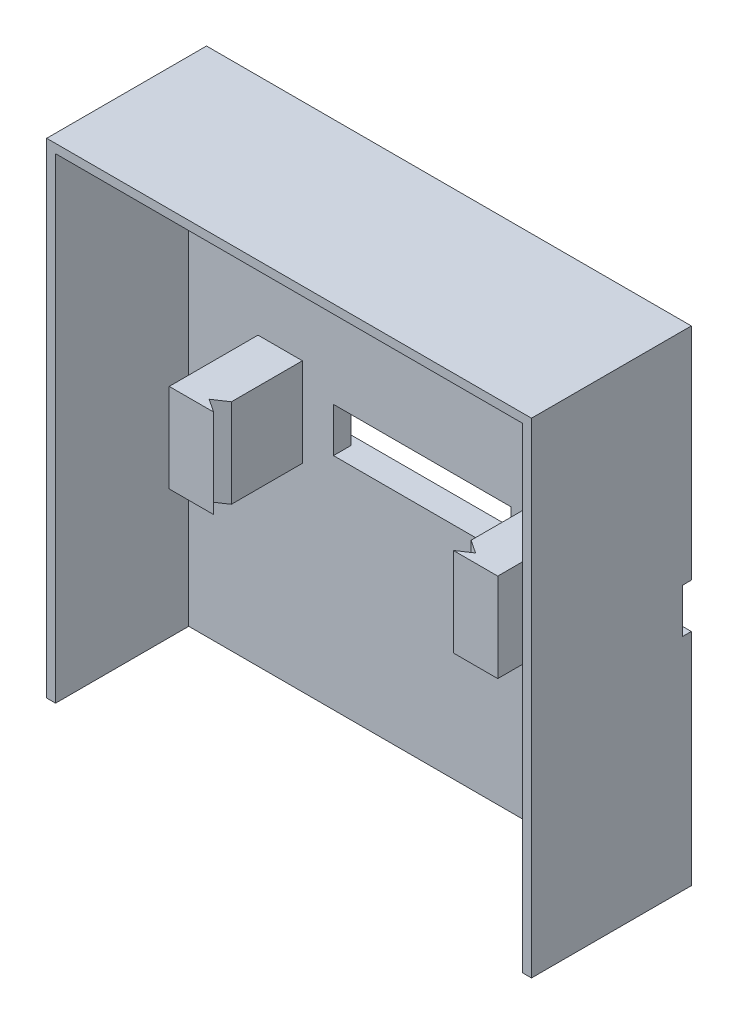
ISO-10303-21;
HEADER;
FILE_DESCRIPTION(('STEP AP214'),'2;1');
FILE_NAME('part.step','',(''),(''),'','','');
FILE_SCHEMA(('AUTOMOTIVE_DESIGN { 1 0 10303 214 1 1 1 1 }'));
ENDSEC;
DATA;
#1=APPLICATION_CONTEXT('core data for automotive mechanical design processes');
#2=APPLICATION_PROTOCOL_DEFINITION('international standard','automotive_design',2000,#1);
#3=PRODUCT_CONTEXT('',#1,'mechanical');
#4=PRODUCT('Part','Part','',(#3));
#5=PRODUCT_RELATED_PRODUCT_CATEGORY('part','',(#4));
#6=PRODUCT_DEFINITION_FORMATION('','',#4);
#7=PRODUCT_DEFINITION_CONTEXT('part definition',#1,'design');
#8=PRODUCT_DEFINITION('design','',#6,#7);
#9=PRODUCT_DEFINITION_SHAPE('','',#8);
#10=(LENGTH_UNIT() NAMED_UNIT(*) SI_UNIT(.MILLI.,.METRE.));
#11=(NAMED_UNIT(*) PLANE_ANGLE_UNIT() SI_UNIT($,.RADIAN.));
#12=(NAMED_UNIT(*) SI_UNIT($,.STERADIAN.) SOLID_ANGLE_UNIT());
#13=UNCERTAINTY_MEASURE_WITH_UNIT(LENGTH_MEASURE(1.E-05),#10,'distance_accuracy_value','');
#14=(GEOMETRIC_REPRESENTATION_CONTEXT(3) GLOBAL_UNCERTAINTY_ASSIGNED_CONTEXT((#13)) GLOBAL_UNIT_ASSIGNED_CONTEXT((#10,
#11,#12)) REPRESENTATION_CONTEXT('',''));
#15=CARTESIAN_POINT('',(0.,0.,0.));
#16=DIRECTION('',(0.,0.,1.));
#17=DIRECTION('',(1.,0.,0.));
#18=AXIS2_PLACEMENT_3D('',#15,#16,#17);
#19=CARTESIAN_POINT('',(0.,0.,3.));
#20=DIRECTION('',(0.,0.,1.));
#21=DIRECTION('',(1.,0.,0.));
#22=AXIS2_PLACEMENT_3D('',#19,#20,#21);
#23=PLANE('',#22);
#24=CARTESIAN_POINT('',(18.3,0.,3.));
#25=DIRECTION('',(0.,0.,1.));
#26=DIRECTION('',(1.,0.,0.));
#27=AXIS2_PLACEMENT_3D('',#24,#25,#26);
#28=CIRCLE('',#27,2.);
#29=CARTESIAN_POINT('',(18.5,-1.98997487421324,3.));
#30=VERTEX_POINT('',#29);
#31=CARTESIAN_POINT('',(18.5,1.98997487421324,3.));
#32=VERTEX_POINT('',#31);
#33=EDGE_CURVE('E254',#30,#32,#28,.T.);
#34=ORIENTED_EDGE('',*,*,#33,.F.);
#35=DIRECTION('',(0.,1.,0.));
#36=VECTOR('',#35,1.);
#37=CARTESIAN_POINT('',(18.5,5.,3.));
#38=LINE('',#37,#36);
#39=CARTESIAN_POINT('',(18.5,-5.,3.));
#40=VERTEX_POINT('',#39);
#41=EDGE_CURVE('E261',#40,#30,#38,.T.);
#42=ORIENTED_EDGE('',*,*,#41,.F.);
#43=DIRECTION('',(1.,0.,0.));
#44=VECTOR('',#43,1.);
#45=CARTESIAN_POINT('',(13.5,-5.,3.));
#46=LINE('',#45,#44);
#47=CARTESIAN_POINT('',(13.5,-5.,3.));
#48=VERTEX_POINT('',#47);
#49=EDGE_CURVE('E366',#48,#40,#46,.T.);
#50=ORIENTED_EDGE('',*,*,#49,.F.);
#51=DIRECTION('',(0.,-1.,0.));
#52=VECTOR('',#51,1.);
#53=CARTESIAN_POINT('',(13.5,5.,3.));
#54=LINE('',#53,#52);
#55=CARTESIAN_POINT('',(13.5,5.,3.));
#56=VERTEX_POINT('',#55);
#57=EDGE_CURVE('E379',#56,#48,#54,.T.);
#58=ORIENTED_EDGE('',*,*,#57,.F.);
#59=DIRECTION('',(-1.,0.,0.));
#60=VECTOR('',#59,1.);
#61=CARTESIAN_POINT('',(13.5,5.,3.));
#62=LINE('',#61,#60);
#63=CARTESIAN_POINT('',(18.5,5.,3.));
#64=VERTEX_POINT('',#63);
#65=EDGE_CURVE('E376',#64,#56,#62,.T.);
#66=ORIENTED_EDGE('',*,*,#65,.F.);
#67=EDGE_CURVE('E346',#32,#64,#38,.T.);
#68=ORIENTED_EDGE('',*,*,#67,.F.);
#69=EDGE_LOOP('',(#34,#42,#50,#58,#66,#68));
#70=FACE_BOUND('',#69,.T.);
#71=CARTESIAN_POINT('',(-18.3,0.,3.));
#72=DIRECTION('',(0.,0.,1.));
#73=DIRECTION('',(1.,0.,0.));
#74=AXIS2_PLACEMENT_3D('',#71,#72,#73);
#75=CIRCLE('',#74,2.);
#76=CARTESIAN_POINT('',(-18.5,1.98997487421324,3.));
#77=VERTEX_POINT('',#76);
#78=CARTESIAN_POINT('',(-18.5,-1.98997487421324,3.));
#79=VERTEX_POINT('',#78);
#80=EDGE_CURVE('E278',#77,#79,#75,.T.);
#81=ORIENTED_EDGE('',*,*,#80,.F.);
#82=DIRECTION('',(0.,-1.,0.));
#83=VECTOR('',#82,1.);
#84=CARTESIAN_POINT('',(-18.5,5.,3.));
#85=LINE('',#84,#83);
#86=CARTESIAN_POINT('',(-18.5,5.,3.));
#87=VERTEX_POINT('',#86);
#88=EDGE_CURVE('E274',#87,#77,#85,.T.);
#89=ORIENTED_EDGE('',*,*,#88,.F.);
#90=DIRECTION('',(-1.,0.,0.));
#91=VECTOR('',#90,1.);
#92=CARTESIAN_POINT('',(-13.5,5.,3.));
#93=LINE('',#92,#91);
#94=CARTESIAN_POINT('',(-13.5,5.,3.));
#95=VERTEX_POINT('',#94);
#96=EDGE_CURVE('E395',#95,#87,#93,.T.);
#97=ORIENTED_EDGE('',*,*,#96,.F.);
#98=DIRECTION('',(0.,1.,0.));
#99=VECTOR('',#98,1.);
#100=CARTESIAN_POINT('',(-13.5,5.,3.));
#101=LINE('',#100,#99);
#102=CARTESIAN_POINT('',(-13.5,-5.,3.));
#103=VERTEX_POINT('',#102);
#104=EDGE_CURVE('E408',#103,#95,#101,.T.);
#105=ORIENTED_EDGE('',*,*,#104,.F.);
#106=DIRECTION('',(1.,0.,0.));
#107=VECTOR('',#106,1.);
#108=CARTESIAN_POINT('',(-13.5,-5.,3.));
#109=LINE('',#108,#107);
#110=CARTESIAN_POINT('',(-18.5,-5.,3.));
#111=VERTEX_POINT('',#110);
#112=EDGE_CURVE('E405',#111,#103,#109,.T.);
#113=ORIENTED_EDGE('',*,*,#112,.F.);
#114=EDGE_CURVE('E284',#79,#111,#85,.T.);
#115=ORIENTED_EDGE('',*,*,#114,.F.);
#116=EDGE_LOOP('',(#81,#89,#97,#105,#113,#115));
#117=FACE_BOUND('',#116,.T.);
#118=DIRECTION('',(0.,1.,0.));
#119=VECTOR('',#118,1.);
#120=CARTESIAN_POINT('',(9.99999999999999,2.5,3.));
#121=LINE('',#120,#119);
#122=CARTESIAN_POINT('',(9.99999999999999,-2.5,3.));
#123=VERTEX_POINT('',#122);
#124=CARTESIAN_POINT('',(9.99999999999999,2.5,3.));
#125=VERTEX_POINT('',#124);
#126=EDGE_CURVE('E442',#123,#125,#121,.T.);
#127=ORIENTED_EDGE('',*,*,#126,.F.);
#128=DIRECTION('',(1.,0.,0.));
#129=VECTOR('',#128,1.);
#130=CARTESIAN_POINT('',(-10.,-2.5,3.));
#131=LINE('',#130,#129);
#132=CARTESIAN_POINT('',(-10.,-2.5,3.));
#133=VERTEX_POINT('',#132);
#134=EDGE_CURVE('E452',#133,#123,#131,.T.);
#135=ORIENTED_EDGE('',*,*,#134,.F.);
#136=DIRECTION('',(0.,-1.,0.));
#137=VECTOR('',#136,1.);
#138=CARTESIAN_POINT('',(-10.,2.5,3.));
#139=LINE('',#138,#137);
#140=CARTESIAN_POINT('',(-10.,2.5,3.));
#141=VERTEX_POINT('',#140);
#142=EDGE_CURVE('E459',#141,#133,#139,.T.);
#143=ORIENTED_EDGE('',*,*,#142,.F.);
#144=DIRECTION('',(-1.,0.,0.));
#145=VECTOR('',#144,1.);
#146=CARTESIAN_POINT('',(-10.,2.5,3.));
#147=LINE('',#146,#145);
#148=EDGE_CURVE('E456',#125,#141,#147,.T.);
#149=ORIENTED_EDGE('',*,*,#148,.F.);
#150=EDGE_LOOP('',(#127,#135,#143,#149));
#151=FACE_BOUND('',#150,.T.);
#152=DIRECTION('',(-1.,0.,0.));
#153=VECTOR('',#152,1.);
#154=CARTESIAN_POINT('',(27.3,-27.3,3.));
#155=LINE('',#154,#153);
#156=CARTESIAN_POINT('',(26.3,-27.3,3.));
#157=VERTEX_POINT('',#156);
#158=CARTESIAN_POINT('',(-26.3,-27.3,3.));
#159=VERTEX_POINT('',#158);
#160=EDGE_CURVE('E473',#157,#159,#155,.T.);
#161=ORIENTED_EDGE('',*,*,#160,.F.);
#162=DIRECTION('',(0.,-1.,0.));
#163=VECTOR('',#162,1.);
#164=CARTESIAN_POINT('',(26.3,0.,3.));
#165=LINE('',#164,#163);
#166=CARTESIAN_POINT('',(26.3,26.3,3.));
#167=VERTEX_POINT('',#166);
#168=EDGE_CURVE('E288',#167,#157,#165,.T.);
#169=ORIENTED_EDGE('',*,*,#168,.F.);
#170=DIRECTION('',(1.,0.,0.));
#171=VECTOR('',#170,1.);
#172=CARTESIAN_POINT('',(0.,26.3,3.));
#173=LINE('',#172,#171);
#174=CARTESIAN_POINT('',(-26.3,26.3,3.));
#175=VERTEX_POINT('',#174);
#176=EDGE_CURVE('E285',#175,#167,#173,.T.);
#177=ORIENTED_EDGE('',*,*,#176,.F.);
#178=DIRECTION('',(0.,-1.,0.));
#179=VECTOR('',#178,1.);
#180=CARTESIAN_POINT('',(-26.3,0.,3.));
#181=LINE('',#180,#179);
#182=EDGE_CURVE('E297',#175,#159,#181,.T.);
#183=ORIENTED_EDGE('',*,*,#182,.T.);
#184=EDGE_LOOP('',(#161,#169,#177,#183));
#185=FACE_BOUND('',#184,.T.);
#186=ADVANCED_FACE('F35',(#70,#117,#151,#185),#23,.T.);
#187=CARTESIAN_POINT('',(27.3,27.3,3.));
#188=DIRECTION('',(1.,0.,0.));
#189=DIRECTION('',(0.,1.,0.));
#190=AXIS2_PLACEMENT_3D('',#187,#188,#189);
#191=PLANE('',#190);
#192=DIRECTION('',(0.,-1.,0.));
#193=VECTOR('',#192,1.);
#194=CARTESIAN_POINT('',(27.3,2.5,1.));
#195=LINE('',#194,#193);
#196=CARTESIAN_POINT('',(27.3,2.5,1.));
#197=VERTEX_POINT('',#196);
#198=CARTESIAN_POINT('',(27.3,-2.5,1.));
#199=VERTEX_POINT('',#198);
#200=EDGE_CURVE('E421',#197,#199,#195,.T.);
#201=ORIENTED_EDGE('',*,*,#200,.F.);
#202=DIRECTION('',(0.,0.,-1.));
#203=VECTOR('',#202,1.);
#204=CARTESIAN_POINT('',(27.3,2.5,1.));
#205=LINE('',#204,#203);
#206=CARTESIAN_POINT('',(27.3,2.5,0.));
#207=VERTEX_POINT('',#206);
#208=EDGE_CURVE('E439',#197,#207,#205,.T.);
#209=ORIENTED_EDGE('',*,*,#208,.T.);
#210=DIRECTION('',(0.,-1.,0.));
#211=VECTOR('',#210,1.);
#212=CARTESIAN_POINT('',(27.3,27.3,0.));
#213=LINE('',#212,#211);
#214=CARTESIAN_POINT('',(27.3,27.3,0.));
#215=VERTEX_POINT('',#214);
#216=EDGE_CURVE('E477',#215,#207,#213,.T.);
#217=ORIENTED_EDGE('',*,*,#216,.F.);
#218=DIRECTION('',(0.,0.,-1.));
#219=VECTOR('',#218,1.);
#220=CARTESIAN_POINT('',(27.3,27.3,3.));
#221=LINE('',#220,#219);
#222=CARTESIAN_POINT('',(27.3,27.3,18.));
#223=VERTEX_POINT('',#222);
#224=EDGE_CURVE('E491',#223,#215,#221,.T.);
#225=ORIENTED_EDGE('',*,*,#224,.F.);
#226=DIRECTION('',(0.,1.,0.));
#227=VECTOR('',#226,1.);
#228=CARTESIAN_POINT('',(27.3,0.,18.));
#229=LINE('',#228,#227);
#230=CARTESIAN_POINT('',(27.3,-27.3,18.));
#231=VERTEX_POINT('',#230);
#232=EDGE_CURVE('E302',#231,#223,#229,.T.);
#233=ORIENTED_EDGE('',*,*,#232,.F.);
#234=DIRECTION('',(0.,0.,-1.));
#235=VECTOR('',#234,1.);
#236=CARTESIAN_POINT('',(27.3,-27.3,3.));
#237=LINE('',#236,#235);
#238=CARTESIAN_POINT('',(27.3,-27.3,0.));
#239=VERTEX_POINT('',#238);
#240=EDGE_CURVE('E248',#231,#239,#237,.T.);
#241=ORIENTED_EDGE('',*,*,#240,.T.);
#242=CARTESIAN_POINT('',(27.3,-2.5,0.));
#243=VERTEX_POINT('',#242);
#244=EDGE_CURVE('E486',#243,#239,#213,.T.);
#245=ORIENTED_EDGE('',*,*,#244,.F.);
#246=DIRECTION('',(0.,0.,-1.));
#247=VECTOR('',#246,1.);
#248=CARTESIAN_POINT('',(27.3,-2.5,1.));
#249=LINE('',#248,#247);
#250=EDGE_CURVE('E435',#199,#243,#249,.T.);
#251=ORIENTED_EDGE('',*,*,#250,.F.);
#252=EDGE_LOOP('',(#201,#209,#217,#225,#233,#241,#245,#251));
#253=FACE_BOUND('',#252,.T.);
#254=ADVANCED_FACE('F511',(#253),#191,.T.);
#255=CARTESIAN_POINT('',(-27.3,27.3,3.));
#256=DIRECTION('',(1.,0.,0.));
#257=DIRECTION('',(0.,1.,0.));
#258=AXIS2_PLACEMENT_3D('',#255,#256,#257);
#259=PLANE('',#258);
#260=DIRECTION('',(0.,0.,-1.));
#261=VECTOR('',#260,1.);
#262=CARTESIAN_POINT('',(-27.3,2.5,1.));
#263=LINE('',#262,#261);
#264=CARTESIAN_POINT('',(-27.3,2.5,1.));
#265=VERTEX_POINT('',#264);
#266=CARTESIAN_POINT('',(-27.3,2.5,0.));
#267=VERTEX_POINT('',#266);
#268=EDGE_CURVE('E443',#265,#267,#263,.T.);
#269=ORIENTED_EDGE('',*,*,#268,.F.);
#270=DIRECTION('',(0.,-1.,0.));
#271=VECTOR('',#270,1.);
#272=CARTESIAN_POINT('',(-27.3,2.5,1.));
#273=LINE('',#272,#271);
#274=CARTESIAN_POINT('',(-27.3,-2.5,1.));
#275=VERTEX_POINT('',#274);
#276=EDGE_CURVE('E428',#265,#275,#273,.T.);
#277=ORIENTED_EDGE('',*,*,#276,.T.);
#278=DIRECTION('',(0.,0.,-1.));
#279=VECTOR('',#278,1.);
#280=CARTESIAN_POINT('',(-27.3,-2.5,1.));
#281=LINE('',#280,#279);
#282=CARTESIAN_POINT('',(-27.3,-2.5,0.));
#283=VERTEX_POINT('',#282);
#284=EDGE_CURVE('E445',#275,#283,#281,.T.);
#285=ORIENTED_EDGE('',*,*,#284,.T.);
#286=DIRECTION('',(0.,-1.,0.));
#287=VECTOR('',#286,1.);
#288=CARTESIAN_POINT('',(-27.3,27.3,0.));
#289=LINE('',#288,#287);
#290=CARTESIAN_POINT('',(-27.3,-27.3,0.));
#291=VERTEX_POINT('',#290);
#292=EDGE_CURVE('E480',#283,#291,#289,.T.);
#293=ORIENTED_EDGE('',*,*,#292,.T.);
#294=DIRECTION('',(0.,0.,-1.));
#295=VECTOR('',#294,1.);
#296=CARTESIAN_POINT('',(-27.3,-27.3,3.));
#297=LINE('',#296,#295);
#298=CARTESIAN_POINT('',(-27.3,-27.3,18.));
#299=VERTEX_POINT('',#298);
#300=EDGE_CURVE('E476',#299,#291,#297,.T.);
#301=ORIENTED_EDGE('',*,*,#300,.F.);
#302=DIRECTION('',(0.,-1.,0.));
#303=VECTOR('',#302,1.);
#304=CARTESIAN_POINT('',(-27.3,0.,18.));
#305=LINE('',#304,#303);
#306=CARTESIAN_POINT('',(-27.3,27.3,18.));
#307=VERTEX_POINT('',#306);
#308=EDGE_CURVE('E309',#307,#299,#305,.T.);
#309=ORIENTED_EDGE('',*,*,#308,.F.);
#310=DIRECTION('',(0.,0.,-1.));
#311=VECTOR('',#310,1.);
#312=CARTESIAN_POINT('',(-27.3,27.3,3.));
#313=LINE('',#312,#311);
#314=CARTESIAN_POINT('',(-27.3,27.3,0.));
#315=VERTEX_POINT('',#314);
#316=EDGE_CURVE('E493',#307,#315,#313,.T.);
#317=ORIENTED_EDGE('',*,*,#316,.T.);
#318=EDGE_CURVE('E481',#315,#267,#289,.T.);
#319=ORIENTED_EDGE('',*,*,#318,.T.);
#320=EDGE_LOOP('',(#269,#277,#285,#293,#301,#309,#317,#319));
#321=FACE_BOUND('',#320,.T.);
#322=ADVANCED_FACE('F527',(#321),#259,.F.);
#323=CARTESIAN_POINT('',(0.,0.,0.));
#324=DIRECTION('',(0.,0.,1.));
#325=DIRECTION('',(1.,0.,0.));
#326=AXIS2_PLACEMENT_3D('',#323,#324,#325);
#327=PLANE('',#326);
#328=DIRECTION('',(-1.,0.,0.));
#329=VECTOR('',#328,1.);
#330=CARTESIAN_POINT('',(27.3,2.5,0.));
#331=LINE('',#330,#329);
#332=EDGE_CURVE('E425',#207,#267,#331,.T.);
#333=ORIENTED_EDGE('',*,*,#332,.T.);
#334=ORIENTED_EDGE('',*,*,#318,.F.);
#335=DIRECTION('',(-1.,0.,0.));
#336=VECTOR('',#335,1.);
#337=CARTESIAN_POINT('',(27.3,27.3,0.));
#338=LINE('',#337,#336);
#339=EDGE_CURVE('E484',#215,#315,#338,.T.);
#340=ORIENTED_EDGE('',*,*,#339,.F.);
#341=ORIENTED_EDGE('',*,*,#216,.T.);
#342=EDGE_LOOP('',(#333,#334,#340,#341));
#343=FACE_BOUND('',#342,.T.);
#344=ADVANCED_FACE('F532',(#343),#327,.F.);
#345=CARTESIAN_POINT('',(27.3,-27.3,3.));
#346=DIRECTION('',(0.,-1.,0.));
#347=DIRECTION('',(1.,0.,0.));
#348=AXIS2_PLACEMENT_3D('',#345,#346,#347);
#349=PLANE('',#348);
#350=DIRECTION('',(-1.,0.,0.));
#351=VECTOR('',#350,1.);
#352=CARTESIAN_POINT('',(27.3,-27.3,0.));
#353=LINE('',#352,#351);
#354=EDGE_CURVE('E466',#239,#291,#353,.T.);
#355=ORIENTED_EDGE('',*,*,#354,.F.);
#356=ORIENTED_EDGE('',*,*,#240,.F.);
#357=DIRECTION('',(1.,0.,0.));
#358=VECTOR('',#357,1.);
#359=CARTESIAN_POINT('',(0.,-27.3,18.));
#360=LINE('',#359,#358);
#361=CARTESIAN_POINT('',(26.3,-27.3,18.));
#362=VERTEX_POINT('',#361);
#363=EDGE_CURVE('E299',#362,#231,#360,.T.);
#364=ORIENTED_EDGE('',*,*,#363,.F.);
#365=DIRECTION('',(0.,0.,-1.));
#366=VECTOR('',#365,1.);
#367=CARTESIAN_POINT('',(26.3,-27.3,18.));
#368=LINE('',#367,#366);
#369=EDGE_CURVE('E324',#362,#157,#368,.T.);
#370=ORIENTED_EDGE('',*,*,#369,.T.);
#371=ORIENTED_EDGE('',*,*,#160,.T.);
#372=DIRECTION('',(0.,0.,-1.));
#373=VECTOR('',#372,1.);
#374=CARTESIAN_POINT('',(-26.3,-27.3,18.));
#375=LINE('',#374,#373);
#376=CARTESIAN_POINT('',(-26.3,-27.3,18.));
#377=VERTEX_POINT('',#376);
#378=EDGE_CURVE('E321',#377,#159,#375,.T.);
#379=ORIENTED_EDGE('',*,*,#378,.F.);
#380=EDGE_CURVE('E303',#299,#377,#360,.T.);
#381=ORIENTED_EDGE('',*,*,#380,.F.);
#382=ORIENTED_EDGE('',*,*,#300,.T.);
#383=EDGE_LOOP('',(#355,#356,#364,#370,#371,#379,#381,#382));
#384=FACE_BOUND('',#383,.T.);
#385=ADVANCED_FACE('F37',(#384),#349,.T.);
#386=CARTESIAN_POINT('',(27.3,27.3,3.));
#387=DIRECTION('',(0.,-1.,0.));
#388=DIRECTION('',(1.,0.,0.));
#389=AXIS2_PLACEMENT_3D('',#386,#387,#388);
#390=PLANE('',#389);
#391=ORIENTED_EDGE('',*,*,#339,.T.);
#392=ORIENTED_EDGE('',*,*,#316,.F.);
#393=DIRECTION('',(-1.,0.,0.));
#394=VECTOR('',#393,1.);
#395=CARTESIAN_POINT('',(0.,27.3,18.));
#396=LINE('',#395,#394);
#397=EDGE_CURVE('E306',#223,#307,#396,.T.);
#398=ORIENTED_EDGE('',*,*,#397,.F.);
#399=ORIENTED_EDGE('',*,*,#224,.T.);
#400=EDGE_LOOP('',(#391,#392,#398,#399));
#401=FACE_BOUND('',#400,.T.);
#402=ADVANCED_FACE('F579',(#401),#390,.F.);
#403=ORIENTED_EDGE('',*,*,#292,.F.);
#404=DIRECTION('',(-1.,0.,0.));
#405=VECTOR('',#404,1.);
#406=CARTESIAN_POINT('',(27.3,-2.5,0.));
#407=LINE('',#406,#405);
#408=EDGE_CURVE('E420',#243,#283,#407,.T.);
#409=ORIENTED_EDGE('',*,*,#408,.F.);
#410=ORIENTED_EDGE('',*,*,#244,.T.);
#411=ORIENTED_EDGE('',*,*,#354,.T.);
#412=EDGE_LOOP('',(#403,#409,#410,#411));
#413=FACE_BOUND('',#412,.T.);
#414=ADVANCED_FACE('F504',(#413),#327,.F.);
#415=CARTESIAN_POINT('',(9.99999999999999,2.5,1.));
#416=DIRECTION('',(1.,0.,0.));
#417=DIRECTION('',(0.,0.,-1.));
#418=AXIS2_PLACEMENT_3D('',#415,#416,#417);
#419=PLANE('',#418);
#420=ORIENTED_EDGE('',*,*,#126,.T.);
#421=DIRECTION('',(0.,0.,1.));
#422=VECTOR('',#421,1.);
#423=CARTESIAN_POINT('',(9.99999999999999,2.5,1.));
#424=LINE('',#423,#422);
#425=CARTESIAN_POINT('',(10.,2.5,1.));
#426=VERTEX_POINT('',#425);
#427=EDGE_CURVE('E454',#426,#125,#424,.T.);
#428=ORIENTED_EDGE('',*,*,#427,.F.);
#429=DIRECTION('',(0.,1.,0.));
#430=VECTOR('',#429,1.);
#431=CARTESIAN_POINT('',(9.99999999999999,2.5,1.));
#432=LINE('',#431,#430);
#433=CARTESIAN_POINT('',(10.,-2.5,1.));
#434=VERTEX_POINT('',#433);
#435=EDGE_CURVE('E449',#434,#426,#432,.T.);
#436=ORIENTED_EDGE('',*,*,#435,.F.);
#437=DIRECTION('',(0.,0.,1.));
#438=VECTOR('',#437,1.);
#439=CARTESIAN_POINT('',(9.99999999999999,-2.5,1.));
#440=LINE('',#439,#438);
#441=EDGE_CURVE('E464',#434,#123,#440,.T.);
#442=ORIENTED_EDGE('',*,*,#441,.T.);
#443=EDGE_LOOP('',(#420,#428,#436,#442));
#444=FACE_BOUND('',#443,.T.);
#445=ADVANCED_FACE('F544',(#444),#419,.F.);
#446=CARTESIAN_POINT('',(-10.,-2.5,1.));
#447=DIRECTION('',(0.,-1.,0.));
#448=DIRECTION('',(0.,0.,-1.));
#449=AXIS2_PLACEMENT_3D('',#446,#447,#448);
#450=PLANE('',#449);
#451=ORIENTED_EDGE('',*,*,#134,.T.);
#452=ORIENTED_EDGE('',*,*,#441,.F.);
#453=DIRECTION('',(-1.,0.,0.));
#454=VECTOR('',#453,1.);
#455=CARTESIAN_POINT('',(27.3,-2.5,1.));
#456=LINE('',#455,#454);
#457=EDGE_CURVE('E426',#199,#434,#456,.T.);
#458=ORIENTED_EDGE('',*,*,#457,.F.);
#459=ORIENTED_EDGE('',*,*,#250,.T.);
#460=ORIENTED_EDGE('',*,*,#408,.T.);
#461=ORIENTED_EDGE('',*,*,#284,.F.);
#462=CARTESIAN_POINT('',(-9.99999999999999,-2.5,1.));
#463=VERTEX_POINT('',#462);
#464=EDGE_CURVE('E424',#463,#275,#456,.T.);
#465=ORIENTED_EDGE('',*,*,#464,.F.);
#466=DIRECTION('',(0.,0.,1.));
#467=VECTOR('',#466,1.);
#468=CARTESIAN_POINT('',(-10.,-2.5,1.));
#469=LINE('',#468,#467);
#470=EDGE_CURVE('E467',#463,#133,#469,.T.);
#471=ORIENTED_EDGE('',*,*,#470,.T.);
#472=EDGE_LOOP('',(#451,#452,#458,#459,#460,#461,#465,#471));
#473=FACE_BOUND('',#472,.T.);
#474=ADVANCED_FACE('F559',(#473),#450,.F.);
#475=CARTESIAN_POINT('',(-10.,2.5,1.));
#476=DIRECTION('',(-1.,0.,0.));
#477=DIRECTION('',(0.,0.,1.));
#478=AXIS2_PLACEMENT_3D('',#475,#476,#477);
#479=PLANE('',#478);
#480=ORIENTED_EDGE('',*,*,#142,.T.);
#481=ORIENTED_EDGE('',*,*,#470,.F.);
#482=DIRECTION('',(0.,-1.,0.));
#483=VECTOR('',#482,1.);
#484=CARTESIAN_POINT('',(-10.,2.5,1.));
#485=LINE('',#484,#483);
#486=CARTESIAN_POINT('',(-10.,2.5,1.));
#487=VERTEX_POINT('',#486);
#488=EDGE_CURVE('E451',#487,#463,#485,.T.);
#489=ORIENTED_EDGE('',*,*,#488,.F.);
#490=DIRECTION('',(0.,0.,1.));
#491=VECTOR('',#490,1.);
#492=CARTESIAN_POINT('',(-10.,2.5,1.));
#493=LINE('',#492,#491);
#494=EDGE_CURVE('E469',#487,#141,#493,.T.);
#495=ORIENTED_EDGE('',*,*,#494,.T.);
#496=EDGE_LOOP('',(#480,#481,#489,#495));
#497=FACE_BOUND('',#496,.T.);
#498=ADVANCED_FACE('F553',(#497),#479,.F.);
#499=CARTESIAN_POINT('',(-10.,2.5,1.));
#500=DIRECTION('',(0.,1.,0.));
#501=DIRECTION('',(0.,0.,1.));
#502=AXIS2_PLACEMENT_3D('',#499,#500,#501);
#503=PLANE('',#502);
#504=ORIENTED_EDGE('',*,*,#148,.T.);
#505=ORIENTED_EDGE('',*,*,#494,.F.);
#506=DIRECTION('',(-1.,0.,0.));
#507=VECTOR('',#506,1.);
#508=CARTESIAN_POINT('',(27.3,2.5,1.));
#509=LINE('',#508,#507);
#510=EDGE_CURVE('E431',#487,#265,#509,.T.);
#511=ORIENTED_EDGE('',*,*,#510,.T.);
#512=ORIENTED_EDGE('',*,*,#268,.T.);
#513=ORIENTED_EDGE('',*,*,#332,.F.);
#514=ORIENTED_EDGE('',*,*,#208,.F.);
#515=EDGE_CURVE('E432',#197,#426,#509,.T.);
#516=ORIENTED_EDGE('',*,*,#515,.T.);
#517=ORIENTED_EDGE('',*,*,#427,.T.);
#518=EDGE_LOOP('',(#504,#505,#511,#512,#513,#514,#516,#517));
#519=FACE_BOUND('',#518,.T.);
#520=ADVANCED_FACE('F535',(#519),#503,.F.);
#521=CARTESIAN_POINT('',(0.,0.,1.));
#522=DIRECTION('',(0.,0.,-1.));
#523=DIRECTION('',(-1.,0.,0.));
#524=AXIS2_PLACEMENT_3D('',#521,#522,#523);
#525=PLANE('',#524);
#526=CARTESIAN_POINT('',(18.3,0.,1.));
#527=DIRECTION('',(0.,0.,-1.));
#528=DIRECTION('',(-1.,0.,0.));
#529=AXIS2_PLACEMENT_3D('',#526,#527,#528);
#530=CIRCLE('',#529,2.);
#531=CARTESIAN_POINT('',(16.3,0.,1.));
#532=VERTEX_POINT('',#531);
#533=EDGE_CURVE('E255',#532,#532,#530,.T.);
#534=ORIENTED_EDGE('',*,*,#533,.F.);
#535=EDGE_LOOP('',(#534));
#536=FACE_BOUND('',#535,.T.);
#537=ORIENTED_EDGE('',*,*,#435,.T.);
#538=ORIENTED_EDGE('',*,*,#515,.F.);
#539=ORIENTED_EDGE('',*,*,#200,.T.);
#540=ORIENTED_EDGE('',*,*,#457,.T.);
#541=EDGE_LOOP('',(#537,#538,#539,#540));
#542=FACE_BOUND('',#541,.T.);
#543=ADVANCED_FACE('F538',(#536,#542),#525,.T.);
#544=CARTESIAN_POINT('',(-18.3,0.,1.));
#545=DIRECTION('',(0.,0.,-1.));
#546=DIRECTION('',(-1.,0.,0.));
#547=AXIS2_PLACEMENT_3D('',#544,#545,#546);
#548=CIRCLE('',#547,2.);
#549=CARTESIAN_POINT('',(-20.3,0.,1.));
#550=VERTEX_POINT('',#549);
#551=EDGE_CURVE('E871',#550,#550,#548,.T.);
#552=ORIENTED_EDGE('',*,*,#551,.F.);
#553=EDGE_LOOP('',(#552));
#554=FACE_BOUND('',#553,.T.);
#555=ORIENTED_EDGE('',*,*,#488,.T.);
#556=ORIENTED_EDGE('',*,*,#464,.T.);
#557=ORIENTED_EDGE('',*,*,#276,.F.);
#558=ORIENTED_EDGE('',*,*,#510,.F.);
#559=EDGE_LOOP('',(#555,#556,#557,#558));
#560=FACE_BOUND('',#559,.T.);
#561=ADVANCED_FACE('F556',(#554,#560),#525,.T.);
#562=CARTESIAN_POINT('',(-18.5,5.,13.));
#563=DIRECTION('',(1.,0.,0.));
#564=DIRECTION('',(0.,1.,0.));
#565=AXIS2_PLACEMENT_3D('',#562,#563,#564);
#566=PLANE('',#565);
#567=DIRECTION('',(0.,1.,0.));
#568=VECTOR('',#567,1.);
#569=CARTESIAN_POINT('',(-18.5,5.,5.));
#570=LINE('',#569,#568);
#571=CARTESIAN_POINT('',(-18.5,-1.98997487421324,5.));
#572=VERTEX_POINT('',#571);
#573=CARTESIAN_POINT('',(-18.5,1.98997487421324,5.));
#574=VERTEX_POINT('',#573);
#575=EDGE_CURVE('E263',#572,#574,#570,.T.);
#576=ORIENTED_EDGE('',*,*,#575,.F.);
#577=DIRECTION('',(0.,0.,-1.));
#578=VECTOR('',#577,1.);
#579=CARTESIAN_POINT('',(-18.5,-1.98997487421324,5.));
#580=LINE('',#579,#578);
#581=EDGE_CURVE('E11',#572,#79,#580,.T.);
#582=ORIENTED_EDGE('',*,*,#581,.T.);
#583=ORIENTED_EDGE('',*,*,#114,.T.);
#584=DIRECTION('',(0.,0.,-1.));
#585=VECTOR('',#584,1.);
#586=CARTESIAN_POINT('',(-18.5,-5.,13.));
#587=LINE('',#586,#585);
#588=CARTESIAN_POINT('',(-18.5,-5.,13.));
#589=VERTEX_POINT('',#588);
#590=EDGE_CURVE('E417',#589,#111,#587,.T.);
#591=ORIENTED_EDGE('',*,*,#590,.F.);
#592=DIRECTION('',(0.,-1.,0.));
#593=VECTOR('',#592,1.);
#594=CARTESIAN_POINT('',(-18.5,5.,13.));
#595=LINE('',#594,#593);
#596=CARTESIAN_POINT('',(-18.5,5.,13.));
#597=VERTEX_POINT('',#596);
#598=EDGE_CURVE('E391',#597,#589,#595,.T.);
#599=ORIENTED_EDGE('',*,*,#598,.F.);
#600=DIRECTION('',(0.,0.,-1.));
#601=VECTOR('',#600,1.);
#602=CARTESIAN_POINT('',(-18.5,5.,13.));
#603=LINE('',#602,#601);
#604=EDGE_CURVE('E403',#597,#87,#603,.T.);
#605=ORIENTED_EDGE('',*,*,#604,.T.);
#606=ORIENTED_EDGE('',*,*,#88,.T.);
#607=DIRECTION('',(0.,0.,-1.));
#608=VECTOR('',#607,1.);
#609=CARTESIAN_POINT('',(-18.5,1.98997487421324,5.));
#610=LINE('',#609,#608);
#611=EDGE_CURVE('E43',#77,#574,#610,.F.);
#612=ORIENTED_EDGE('',*,*,#611,.T.);
#613=EDGE_LOOP('',(#576,#582,#583,#591,#599,#605,#606,#612));
#614=FACE_BOUND('',#613,.T.);
#615=ADVANCED_FACE('F271',(#614),#566,.F.);
#616=CARTESIAN_POINT('',(-13.5,-5.,13.));
#617=DIRECTION('',(0.,1.,0.));
#618=DIRECTION('',(-1.,0.,0.));
#619=AXIS2_PLACEMENT_3D('',#616,#617,#618);
#620=PLANE('',#619);
#621=DIRECTION('',(-0.832050294337844,0.,0.554700196225229));
#622=VECTOR('',#621,1.);
#623=CARTESIAN_POINT('',(-13.5,-5.,11.));
#624=LINE('',#623,#622);
#625=CARTESIAN_POINT('',(-13.5,-5.,11.));
#626=VERTEX_POINT('',#625);
#627=CARTESIAN_POINT('',(-15.,-5.,12.));
#628=VERTEX_POINT('',#627);
#629=EDGE_CURVE('E334',#626,#628,#624,.T.);
#630=ORIENTED_EDGE('',*,*,#629,.T.);
#631=DIRECTION('',(0.832050294337843,0.,0.55470019622523));
#632=VECTOR('',#631,1.);
#633=CARTESIAN_POINT('',(-15.,-5.,12.));
#634=LINE('',#633,#632);
#635=CARTESIAN_POINT('',(-13.5,-5.,13.));
#636=VERTEX_POINT('',#635);
#637=EDGE_CURVE('E331',#628,#636,#634,.T.);
#638=ORIENTED_EDGE('',*,*,#637,.T.);
#639=DIRECTION('',(1.,0.,0.));
#640=VECTOR('',#639,1.);
#641=CARTESIAN_POINT('',(-13.5,-5.,13.));
#642=LINE('',#641,#640);
#643=EDGE_CURVE('E394',#589,#636,#642,.T.);
#644=ORIENTED_EDGE('',*,*,#643,.F.);
#645=ORIENTED_EDGE('',*,*,#590,.T.);
#646=ORIENTED_EDGE('',*,*,#112,.T.);
#647=DIRECTION('',(0.,0.,-1.));
#648=VECTOR('',#647,1.);
#649=CARTESIAN_POINT('',(-13.5,-5.,13.));
#650=LINE('',#649,#648);
#651=EDGE_CURVE('E415',#626,#103,#650,.T.);
#652=ORIENTED_EDGE('',*,*,#651,.F.);
#653=EDGE_LOOP('',(#630,#638,#644,#645,#646,#652));
#654=FACE_BOUND('',#653,.T.);
#655=ADVANCED_FACE('F631',(#654),#620,.F.);
#656=CARTESIAN_POINT('',(-13.5,5.,13.));
#657=DIRECTION('',(-1.,0.,0.));
#658=DIRECTION('',(0.,-1.,0.));
#659=AXIS2_PLACEMENT_3D('',#656,#657,#658);
#660=PLANE('',#659);
#661=DIRECTION('',(0.,0.,-1.));
#662=VECTOR('',#661,1.);
#663=CARTESIAN_POINT('',(-13.5,5.,13.));
#664=LINE('',#663,#662);
#665=CARTESIAN_POINT('',(-13.5,5.,11.));
#666=VERTEX_POINT('',#665);
#667=EDGE_CURVE('E413',#666,#95,#664,.T.);
#668=ORIENTED_EDGE('',*,*,#667,.F.);
#669=DIRECTION('',(0.,1.,0.));
#670=VECTOR('',#669,1.);
#671=CARTESIAN_POINT('',(-13.5,-5.,11.));
#672=LINE('',#671,#670);
#673=EDGE_CURVE('E338',#626,#666,#672,.T.);
#674=ORIENTED_EDGE('',*,*,#673,.F.);
#675=ORIENTED_EDGE('',*,*,#651,.T.);
#676=ORIENTED_EDGE('',*,*,#104,.T.);
#677=EDGE_LOOP('',(#668,#674,#675,#676));
#678=FACE_BOUND('',#677,.T.);
#679=ADVANCED_FACE('F636',(#678),#660,.F.);
#680=CARTESIAN_POINT('',(-13.5,5.,13.));
#681=DIRECTION('',(0.,-1.,0.));
#682=DIRECTION('',(1.,0.,0.));
#683=AXIS2_PLACEMENT_3D('',#680,#681,#682);
#684=PLANE('',#683);
#685=DIRECTION('',(-1.,0.,0.));
#686=VECTOR('',#685,1.);
#687=CARTESIAN_POINT('',(-13.5,5.,13.));
#688=LINE('',#687,#686);
#689=CARTESIAN_POINT('',(-13.5,5.,13.));
#690=VERTEX_POINT('',#689);
#691=EDGE_CURVE('E401',#690,#597,#688,.T.);
#692=ORIENTED_EDGE('',*,*,#691,.F.);
#693=DIRECTION('',(0.832050294337843,0.,0.55470019622523));
#694=VECTOR('',#693,1.);
#695=CARTESIAN_POINT('',(-15.,5.,12.));
#696=LINE('',#695,#694);
#697=CARTESIAN_POINT('',(-15.,5.,12.));
#698=VERTEX_POINT('',#697);
#699=EDGE_CURVE('E339',#698,#690,#696,.T.);
#700=ORIENTED_EDGE('',*,*,#699,.F.);
#701=DIRECTION('',(-0.832050294337844,0.,0.554700196225229));
#702=VECTOR('',#701,1.);
#703=CARTESIAN_POINT('',(-13.5,5.,11.));
#704=LINE('',#703,#702);
#705=EDGE_CURVE('E335',#666,#698,#704,.T.);
#706=ORIENTED_EDGE('',*,*,#705,.F.);
#707=ORIENTED_EDGE('',*,*,#667,.T.);
#708=ORIENTED_EDGE('',*,*,#96,.T.);
#709=ORIENTED_EDGE('',*,*,#604,.F.);
#710=EDGE_LOOP('',(#692,#700,#706,#707,#708,#709));
#711=FACE_BOUND('',#710,.T.);
#712=ADVANCED_FACE('F648',(#711),#684,.F.);
#713=CARTESIAN_POINT('',(0.,0.,13.));
#714=DIRECTION('',(0.,0.,-1.));
#715=DIRECTION('',(-1.,0.,0.));
#716=AXIS2_PLACEMENT_3D('',#713,#714,#715);
#717=PLANE('',#716);
#718=ORIENTED_EDGE('',*,*,#598,.T.);
#719=ORIENTED_EDGE('',*,*,#643,.T.);
#720=DIRECTION('',(0.,1.,0.));
#721=VECTOR('',#720,1.);
#722=CARTESIAN_POINT('',(-13.5,5.,13.));
#723=LINE('',#722,#721);
#724=EDGE_CURVE('E398',#636,#690,#723,.T.);
#725=ORIENTED_EDGE('',*,*,#724,.T.);
#726=ORIENTED_EDGE('',*,*,#691,.T.);
#727=EDGE_LOOP('',(#718,#719,#725,#726));
#728=FACE_BOUND('',#727,.T.);
#729=ADVANCED_FACE('F658',(#728),#717,.F.);
#730=CARTESIAN_POINT('',(18.5,5.,13.));
#731=DIRECTION('',(-1.,0.,0.));
#732=DIRECTION('',(0.,0.,1.));
#733=AXIS2_PLACEMENT_3D('',#730,#731,#732);
#734=PLANE('',#733);
#735=DIRECTION('',(0.,-1.,0.));
#736=VECTOR('',#735,1.);
#737=CARTESIAN_POINT('',(18.5,5.,5.));
#738=LINE('',#737,#736);
#739=CARTESIAN_POINT('',(18.5,1.98997487421324,5.));
#740=VERTEX_POINT('',#739);
#741=CARTESIAN_POINT('',(18.5,-1.98997487421324,5.));
#742=VERTEX_POINT('',#741);
#743=EDGE_CURVE('E242',#740,#742,#738,.T.);
#744=ORIENTED_EDGE('',*,*,#743,.F.);
#745=DIRECTION('',(0.,0.,-1.));
#746=VECTOR('',#745,1.);
#747=CARTESIAN_POINT('',(18.5,1.98997487421324,5.));
#748=LINE('',#747,#746);
#749=EDGE_CURVE('E253',#740,#32,#748,.T.);
#750=ORIENTED_EDGE('',*,*,#749,.T.);
#751=ORIENTED_EDGE('',*,*,#67,.T.);
#752=DIRECTION('',(0.,0.,-1.));
#753=VECTOR('',#752,1.);
#754=CARTESIAN_POINT('',(18.5,5.,13.));
#755=LINE('',#754,#753);
#756=CARTESIAN_POINT('',(18.5,5.,13.));
#757=VERTEX_POINT('',#756);
#758=EDGE_CURVE('E388',#757,#64,#755,.T.);
#759=ORIENTED_EDGE('',*,*,#758,.F.);
#760=DIRECTION('',(0.,1.,0.));
#761=VECTOR('',#760,1.);
#762=CARTESIAN_POINT('',(18.5,5.,13.));
#763=LINE('',#762,#761);
#764=CARTESIAN_POINT('',(18.5,-5.,13.));
#765=VERTEX_POINT('',#764);
#766=EDGE_CURVE('E362',#765,#757,#763,.T.);
#767=ORIENTED_EDGE('',*,*,#766,.F.);
#768=DIRECTION('',(0.,0.,-1.));
#769=VECTOR('',#768,1.);
#770=CARTESIAN_POINT('',(18.5,-5.,13.));
#771=LINE('',#770,#769);
#772=EDGE_CURVE('E374',#765,#40,#771,.T.);
#773=ORIENTED_EDGE('',*,*,#772,.T.);
#774=ORIENTED_EDGE('',*,*,#41,.T.);
#775=DIRECTION('',(0.,0.,-1.));
#776=VECTOR('',#775,1.);
#777=CARTESIAN_POINT('',(18.5,-1.98997487421324,5.));
#778=LINE('',#777,#776);
#779=EDGE_CURVE('E247',#30,#742,#778,.F.);
#780=ORIENTED_EDGE('',*,*,#779,.T.);
#781=EDGE_LOOP('',(#744,#750,#751,#759,#767,#773,#774,#780));
#782=FACE_BOUND('',#781,.T.);
#783=ADVANCED_FACE('F258',(#782),#734,.F.);
#784=CARTESIAN_POINT('',(13.5,5.,13.));
#785=DIRECTION('',(0.,-1.,0.));
#786=DIRECTION('',(1.,0.,0.));
#787=AXIS2_PLACEMENT_3D('',#784,#785,#786);
#788=PLANE('',#787);
#789=DIRECTION('',(-0.832050294337844,0.,-0.554700196225229));
#790=VECTOR('',#789,1.);
#791=CARTESIAN_POINT('',(13.5,5.00000000000001,11.));
#792=LINE('',#791,#790);
#793=CARTESIAN_POINT('',(15.,5.00000000000001,12.));
#794=VERTEX_POINT('',#793);
#795=CARTESIAN_POINT('',(13.5,5.00000000000001,11.));
#796=VERTEX_POINT('',#795);
#797=EDGE_CURVE('E352',#794,#796,#792,.T.);
#798=ORIENTED_EDGE('',*,*,#797,.F.);
#799=DIRECTION('',(0.832050294337843,0.,-0.55470019622523));
#800=VECTOR('',#799,1.);
#801=CARTESIAN_POINT('',(15.,5.00000000000001,12.));
#802=LINE('',#801,#800);
#803=CARTESIAN_POINT('',(13.5,5.00000000000001,13.));
#804=VERTEX_POINT('',#803);
#805=EDGE_CURVE('E330',#804,#794,#802,.T.);
#806=ORIENTED_EDGE('',*,*,#805,.F.);
#807=DIRECTION('',(-1.,0.,0.));
#808=VECTOR('',#807,1.);
#809=CARTESIAN_POINT('',(13.5,5.,13.));
#810=LINE('',#809,#808);
#811=EDGE_CURVE('E365',#757,#804,#810,.T.);
#812=ORIENTED_EDGE('',*,*,#811,.F.);
#813=ORIENTED_EDGE('',*,*,#758,.T.);
#814=ORIENTED_EDGE('',*,*,#65,.T.);
#815=DIRECTION('',(0.,0.,-1.));
#816=VECTOR('',#815,1.);
#817=CARTESIAN_POINT('',(13.5,5.,13.));
#818=LINE('',#817,#816);
#819=EDGE_CURVE('E386',#796,#56,#818,.T.);
#820=ORIENTED_EDGE('',*,*,#819,.F.);
#821=EDGE_LOOP('',(#798,#806,#812,#813,#814,#820));
#822=FACE_BOUND('',#821,.T.);
#823=ADVANCED_FACE('F675',(#822),#788,.F.);
#824=CARTESIAN_POINT('',(13.5,5.,13.));
#825=DIRECTION('',(1.,0.,0.));
#826=DIRECTION('',(0.,1.,0.));
#827=AXIS2_PLACEMENT_3D('',#824,#825,#826);
#828=PLANE('',#827);
#829=DIRECTION('',(0.,0.,-1.));
#830=VECTOR('',#829,1.);
#831=CARTESIAN_POINT('',(13.5,-5.,13.));
#832=LINE('',#831,#830);
#833=CARTESIAN_POINT('',(13.5,-4.99999999999999,11.));
#834=VERTEX_POINT('',#833);
#835=EDGE_CURVE('E384',#834,#48,#832,.T.);
#836=ORIENTED_EDGE('',*,*,#835,.F.);
#837=DIRECTION('',(0.,1.,0.));
#838=VECTOR('',#837,1.);
#839=CARTESIAN_POINT('',(13.5,-4.99999999999999,11.));
#840=LINE('',#839,#838);
#841=EDGE_CURVE('E341',#834,#796,#840,.T.);
#842=ORIENTED_EDGE('',*,*,#841,.T.);
#843=ORIENTED_EDGE('',*,*,#819,.T.);
#844=ORIENTED_EDGE('',*,*,#57,.T.);
#845=EDGE_LOOP('',(#836,#842,#843,#844));
#846=FACE_BOUND('',#845,.T.);
#847=ADVANCED_FACE('F680',(#846),#828,.F.);
#848=CARTESIAN_POINT('',(13.5,-5.,13.));
#849=DIRECTION('',(0.,1.,0.));
#850=DIRECTION('',(0.,0.,1.));
#851=AXIS2_PLACEMENT_3D('',#848,#849,#850);
#852=PLANE('',#851);
#853=DIRECTION('',(1.,0.,0.));
#854=VECTOR('',#853,1.);
#855=CARTESIAN_POINT('',(13.5,-5.,13.));
#856=LINE('',#855,#854);
#857=CARTESIAN_POINT('',(13.5,-5.,13.));
#858=VERTEX_POINT('',#857);
#859=EDGE_CURVE('E372',#858,#765,#856,.T.);
#860=ORIENTED_EDGE('',*,*,#859,.F.);
#861=DIRECTION('',(0.832050294337843,0.,-0.55470019622523));
#862=VECTOR('',#861,1.);
#863=CARTESIAN_POINT('',(15.,-4.99999999999999,12.));
#864=LINE('',#863,#862);
#865=CARTESIAN_POINT('',(15.,-4.99999999999999,12.));
#866=VERTEX_POINT('',#865);
#867=EDGE_CURVE('E348',#858,#866,#864,.T.);
#868=ORIENTED_EDGE('',*,*,#867,.T.);
#869=DIRECTION('',(-0.832050294337844,0.,-0.554700196225229));
#870=VECTOR('',#869,1.);
#871=CARTESIAN_POINT('',(13.5,-4.99999999999999,11.));
#872=LINE('',#871,#870);
#873=EDGE_CURVE('E351',#866,#834,#872,.T.);
#874=ORIENTED_EDGE('',*,*,#873,.T.);
#875=ORIENTED_EDGE('',*,*,#835,.T.);
#876=ORIENTED_EDGE('',*,*,#49,.T.);
#877=ORIENTED_EDGE('',*,*,#772,.F.);
#878=EDGE_LOOP('',(#860,#868,#874,#875,#876,#877));
#879=FACE_BOUND('',#878,.T.);
#880=ADVANCED_FACE('F690',(#879),#852,.F.);
#881=CARTESIAN_POINT('',(0.,0.,13.));
#882=DIRECTION('',(0.,0.,1.));
#883=DIRECTION('',(1.,0.,0.));
#884=AXIS2_PLACEMENT_3D('',#881,#882,#883);
#885=PLANE('',#884);
#886=ORIENTED_EDGE('',*,*,#766,.T.);
#887=ORIENTED_EDGE('',*,*,#811,.T.);
#888=DIRECTION('',(0.,-1.,0.));
#889=VECTOR('',#888,1.);
#890=CARTESIAN_POINT('',(13.5,5.,13.));
#891=LINE('',#890,#889);
#892=EDGE_CURVE('E369',#804,#858,#891,.T.);
#893=ORIENTED_EDGE('',*,*,#892,.T.);
#894=ORIENTED_EDGE('',*,*,#859,.T.);
#895=EDGE_LOOP('',(#886,#887,#893,#894));
#896=FACE_BOUND('',#895,.T.);
#897=ADVANCED_FACE('F700',(#896),#885,.T.);
#898=CARTESIAN_POINT('',(15.,-4.99999999999999,12.));
#899=DIRECTION('',(0.55470019622523,0.,0.832050294337843));
#900=DIRECTION('',(0.832050294337843,0.,-0.55470019622523));
#901=AXIS2_PLACEMENT_3D('',#898,#899,#900);
#902=PLANE('',#901);
#903=ORIENTED_EDGE('',*,*,#805,.T.);
#904=DIRECTION('',(0.,1.,0.));
#905=VECTOR('',#904,1.);
#906=CARTESIAN_POINT('',(15.,-4.99999999999999,12.));
#907=LINE('',#906,#905);
#908=EDGE_CURVE('E355',#866,#794,#907,.T.);
#909=ORIENTED_EDGE('',*,*,#908,.F.);
#910=ORIENTED_EDGE('',*,*,#867,.F.);
#911=ORIENTED_EDGE('',*,*,#892,.F.);
#912=EDGE_LOOP('',(#903,#909,#910,#911));
#913=FACE_BOUND('',#912,.T.);
#914=ADVANCED_FACE('F710',(#913),#902,.F.);
#915=CARTESIAN_POINT('',(13.5,-4.99999999999999,11.));
#916=DIRECTION('',(0.554700196225229,0.,-0.832050294337844));
#917=DIRECTION('',(-0.832050294337844,0.,-0.554700196225229));
#918=AXIS2_PLACEMENT_3D('',#915,#916,#917);
#919=PLANE('',#918);
#920=ORIENTED_EDGE('',*,*,#797,.T.);
#921=ORIENTED_EDGE('',*,*,#841,.F.);
#922=ORIENTED_EDGE('',*,*,#873,.F.);
#923=ORIENTED_EDGE('',*,*,#908,.T.);
#924=EDGE_LOOP('',(#920,#921,#922,#923));
#925=FACE_BOUND('',#924,.T.);
#926=ADVANCED_FACE('F720',(#925),#919,.F.);
#927=CARTESIAN_POINT('',(-15.,-5.,12.));
#928=DIRECTION('',(-0.55470019622523,0.,0.832050294337843));
#929=DIRECTION('',(0.832050294337843,0.,0.55470019622523));
#930=AXIS2_PLACEMENT_3D('',#927,#928,#929);
#931=PLANE('',#930);
#932=ORIENTED_EDGE('',*,*,#699,.T.);
#933=ORIENTED_EDGE('',*,*,#724,.F.);
#934=ORIENTED_EDGE('',*,*,#637,.F.);
#935=DIRECTION('',(0.,1.,0.));
#936=VECTOR('',#935,1.);
#937=CARTESIAN_POINT('',(-15.,-5.,12.));
#938=LINE('',#937,#936);
#939=EDGE_CURVE('E344',#628,#698,#938,.T.);
#940=ORIENTED_EDGE('',*,*,#939,.T.);
#941=EDGE_LOOP('',(#932,#933,#934,#940));
#942=FACE_BOUND('',#941,.T.);
#943=ADVANCED_FACE('F730',(#942),#931,.F.);
#944=CARTESIAN_POINT('',(-13.5,-5.,11.));
#945=DIRECTION('',(-0.554700196225229,0.,-0.832050294337844));
#946=DIRECTION('',(-0.832050294337844,0.,0.554700196225229));
#947=AXIS2_PLACEMENT_3D('',#944,#945,#946);
#948=PLANE('',#947);
#949=ORIENTED_EDGE('',*,*,#705,.T.);
#950=ORIENTED_EDGE('',*,*,#939,.F.);
#951=ORIENTED_EDGE('',*,*,#629,.F.);
#952=ORIENTED_EDGE('',*,*,#673,.T.);
#953=EDGE_LOOP('',(#949,#950,#951,#952));
#954=FACE_BOUND('',#953,.T.);
#955=ADVANCED_FACE('F740',(#954),#948,.F.);
#956=CARTESIAN_POINT('',(0.,26.3,18.));
#957=DIRECTION('',(0.,1.,0.));
#958=DIRECTION('',(0.,0.,1.));
#959=AXIS2_PLACEMENT_3D('',#956,#957,#958);
#960=PLANE('',#959);
#961=ORIENTED_EDGE('',*,*,#176,.T.);
#962=DIRECTION('',(0.,0.,-1.));
#963=VECTOR('',#962,1.);
#964=CARTESIAN_POINT('',(26.3,26.3,18.));
#965=LINE('',#964,#963);
#966=CARTESIAN_POINT('',(26.3,26.3,18.));
#967=VERTEX_POINT('',#966);
#968=EDGE_CURVE('E327',#967,#167,#965,.T.);
#969=ORIENTED_EDGE('',*,*,#968,.F.);
#970=DIRECTION('',(1.,0.,0.));
#971=VECTOR('',#970,1.);
#972=CARTESIAN_POINT('',(0.,26.3,18.));
#973=LINE('',#972,#971);
#974=CARTESIAN_POINT('',(-26.3,26.3,18.));
#975=VERTEX_POINT('',#974);
#976=EDGE_CURVE('E293',#975,#967,#973,.T.);
#977=ORIENTED_EDGE('',*,*,#976,.F.);
#978=DIRECTION('',(0.,0.,-1.));
#979=VECTOR('',#978,1.);
#980=CARTESIAN_POINT('',(-26.3,26.3,18.));
#981=LINE('',#980,#979);
#982=EDGE_CURVE('E314',#975,#175,#981,.T.);
#983=ORIENTED_EDGE('',*,*,#982,.T.);
#984=EDGE_LOOP('',(#961,#969,#977,#983));
#985=FACE_BOUND('',#984,.T.);
#986=ADVANCED_FACE('F750',(#985),#960,.F.);
#987=CARTESIAN_POINT('',(26.3,0.,18.));
#988=DIRECTION('',(1.,0.,0.));
#989=DIRECTION('',(0.,1.,0.));
#990=AXIS2_PLACEMENT_3D('',#987,#988,#989);
#991=PLANE('',#990);
#992=ORIENTED_EDGE('',*,*,#168,.T.);
#993=ORIENTED_EDGE('',*,*,#369,.F.);
#994=DIRECTION('',(0.,-1.,0.));
#995=VECTOR('',#994,1.);
#996=CARTESIAN_POINT('',(26.3,0.,18.));
#997=LINE('',#996,#995);
#998=EDGE_CURVE('E296',#967,#362,#997,.T.);
#999=ORIENTED_EDGE('',*,*,#998,.F.);
#1000=ORIENTED_EDGE('',*,*,#968,.T.);
#1001=EDGE_LOOP('',(#992,#993,#999,#1000));
#1002=FACE_BOUND('',#1001,.T.);
#1003=ADVANCED_FACE('F521',(#1002),#991,.F.);
#1004=CARTESIAN_POINT('',(-26.3,0.,18.));
#1005=DIRECTION('',(1.,0.,0.));
#1006=DIRECTION('',(0.,1.,0.));
#1007=AXIS2_PLACEMENT_3D('',#1004,#1005,#1006);
#1008=PLANE('',#1007);
#1009=ORIENTED_EDGE('',*,*,#182,.F.);
#1010=ORIENTED_EDGE('',*,*,#982,.F.);
#1011=DIRECTION('',(0.,-1.,0.));
#1012=VECTOR('',#1011,1.);
#1013=CARTESIAN_POINT('',(-26.3,0.,18.));
#1014=LINE('',#1013,#1012);
#1015=EDGE_CURVE('E312',#975,#377,#1014,.T.);
#1016=ORIENTED_EDGE('',*,*,#1015,.T.);
#1017=ORIENTED_EDGE('',*,*,#378,.T.);
#1018=EDGE_LOOP('',(#1009,#1010,#1016,#1017));
#1019=FACE_BOUND('',#1018,.T.);
#1020=ADVANCED_FACE('F525',(#1019),#1008,.T.);
#1021=CARTESIAN_POINT('',(0.,0.,18.));
#1022=DIRECTION('',(0.,0.,1.));
#1023=DIRECTION('',(1.,0.,0.));
#1024=AXIS2_PLACEMENT_3D('',#1021,#1022,#1023);
#1025=PLANE('',#1024);
#1026=ORIENTED_EDGE('',*,*,#976,.T.);
#1027=ORIENTED_EDGE('',*,*,#998,.T.);
#1028=ORIENTED_EDGE('',*,*,#363,.T.);
#1029=ORIENTED_EDGE('',*,*,#232,.T.);
#1030=ORIENTED_EDGE('',*,*,#397,.T.);
#1031=ORIENTED_EDGE('',*,*,#308,.T.);
#1032=ORIENTED_EDGE('',*,*,#380,.T.);
#1033=ORIENTED_EDGE('',*,*,#1015,.F.);
#1034=EDGE_LOOP('',(#1026,#1027,#1028,#1029,#1030,#1031,#1032,#1033));
#1035=FACE_BOUND('',#1034,.T.);
#1036=ADVANCED_FACE('F514',(#1035),#1025,.T.);
#1037=CARTESIAN_POINT('',(18.3,0.,5.));
#1038=DIRECTION('',(0.,0.,-1.));
#1039=DIRECTION('',(-1.,0.,0.));
#1040=AXIS2_PLACEMENT_3D('',#1037,#1038,#1039);
#1041=CYLINDRICAL_SURFACE('',#1040,2.);
#1042=ORIENTED_EDGE('',*,*,#533,.T.);
#1043=EDGE_LOOP('',(#1042));
#1044=FACE_BOUND('',#1043,.T.);
#1045=CARTESIAN_POINT('',(18.3,0.,5.));
#1046=DIRECTION('',(0.,0.,-1.));
#1047=DIRECTION('',(-1.,0.,0.));
#1048=AXIS2_PLACEMENT_3D('',#1045,#1046,#1047);
#1049=CIRCLE('',#1048,2.);
#1050=EDGE_CURVE('E56',#742,#740,#1049,.T.);
#1051=ORIENTED_EDGE('',*,*,#1050,.F.);
#1052=ORIENTED_EDGE('',*,*,#779,.F.);
#1053=ORIENTED_EDGE('',*,*,#33,.T.);
#1054=ORIENTED_EDGE('',*,*,#749,.F.);
#1055=EDGE_LOOP('',(#1051,#1052,#1053,#1054));
#1056=FACE_BOUND('',#1055,.T.);
#1057=ADVANCED_FACE('F251',(#1044,#1056),#1041,.F.);
#1058=CARTESIAN_POINT('',(18.3,0.,5.));
#1059=DIRECTION('',(0.,0.,-1.));
#1060=DIRECTION('',(-1.,0.,0.));
#1061=AXIS2_PLACEMENT_3D('',#1058,#1059,#1060);
#1062=PLANE('',#1061);
#1063=ORIENTED_EDGE('',*,*,#743,.T.);
#1064=ORIENTED_EDGE('',*,*,#1050,.T.);
#1065=EDGE_LOOP('',(#1063,#1064));
#1066=FACE_BOUND('',#1065,.T.);
#1067=ADVANCED_FACE('F243',(#1066),#1062,.T.);
#1068=CARTESIAN_POINT('',(-18.3,0.,5.));
#1069=DIRECTION('',(0.,0.,-1.));
#1070=DIRECTION('',(-1.,0.,0.));
#1071=AXIS2_PLACEMENT_3D('',#1068,#1069,#1070);
#1072=CYLINDRICAL_SURFACE('',#1071,2.);
#1073=ORIENTED_EDGE('',*,*,#551,.T.);
#1074=EDGE_LOOP('',(#1073));
#1075=FACE_BOUND('',#1074,.T.);
#1076=CARTESIAN_POINT('',(-18.3,0.,5.));
#1077=DIRECTION('',(0.,0.,-1.));
#1078=DIRECTION('',(-1.,0.,0.));
#1079=AXIS2_PLACEMENT_3D('',#1076,#1077,#1078);
#1080=CIRCLE('',#1079,2.);
#1081=EDGE_CURVE('E49',#574,#572,#1080,.T.);
#1082=ORIENTED_EDGE('',*,*,#1081,.F.);
#1083=ORIENTED_EDGE('',*,*,#611,.F.);
#1084=ORIENTED_EDGE('',*,*,#80,.T.);
#1085=ORIENTED_EDGE('',*,*,#581,.F.);
#1086=EDGE_LOOP('',(#1082,#1083,#1084,#1085));
#1087=FACE_BOUND('',#1086,.T.);
#1088=ADVANCED_FACE('F277',(#1075,#1087),#1072,.F.);
#1089=CARTESIAN_POINT('',(-18.3,0.,5.));
#1090=DIRECTION('',(0.,0.,-1.));
#1091=DIRECTION('',(-1.,0.,0.));
#1092=AXIS2_PLACEMENT_3D('',#1089,#1090,#1091);
#1093=PLANE('',#1092);
#1094=ORIENTED_EDGE('',*,*,#575,.T.);
#1095=ORIENTED_EDGE('',*,*,#1081,.T.);
#1096=EDGE_LOOP('',(#1094,#1095));
#1097=FACE_BOUND('',#1096,.T.);
#1098=ADVANCED_FACE('F843',(#1097),#1093,.T.);
#1099=CLOSED_SHELL('',(#186,#254,#322,#344,#385,#402,#414,#445,#474,#498,#520,#543,#561,#615,
#655,#679,#712,#729,#783,#823,#847,#880,#897,#914,#926,#943,#955,#986,#1003,#1020,#1036,#1057,
#1067,#1088,#1098));
#1100=MANIFOLD_SOLID_BREP('B2',#1099);
#1101=ADVANCED_BREP_SHAPE_REPRESENTATION('',(#18,#1100),#14);
#1102=SHAPE_DEFINITION_REPRESENTATION(#9,#1101);
ENDSEC;
END-ISO-10303-21;
